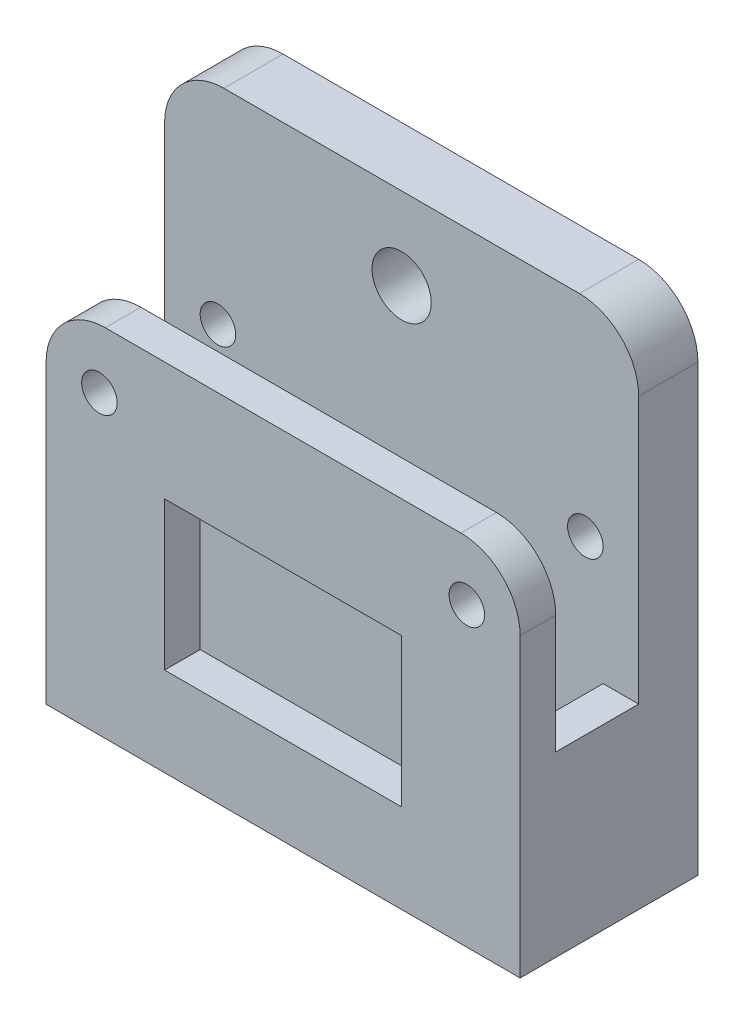
ISO-10303-21;
HEADER;
FILE_DESCRIPTION(('STEP AP214'),'2;1');
FILE_NAME('part.step','',(''),(''),'','','');
FILE_SCHEMA(('AUTOMOTIVE_DESIGN { 1 0 10303 214 1 1 1 1 }'));
ENDSEC;
DATA;
#1=APPLICATION_CONTEXT('core data for automotive mechanical design processes');
#2=APPLICATION_PROTOCOL_DEFINITION('international standard','automotive_design',2000,#1);
#3=PRODUCT_CONTEXT('',#1,'mechanical');
#4=PRODUCT('Part','Part','',(#3));
#5=PRODUCT_RELATED_PRODUCT_CATEGORY('part','',(#4));
#6=PRODUCT_DEFINITION_FORMATION('','',#4);
#7=PRODUCT_DEFINITION_CONTEXT('part definition',#1,'design');
#8=PRODUCT_DEFINITION('design','',#6,#7);
#9=PRODUCT_DEFINITION_SHAPE('','',#8);
#10=(LENGTH_UNIT() NAMED_UNIT(*) SI_UNIT(.MILLI.,.METRE.));
#11=(NAMED_UNIT(*) PLANE_ANGLE_UNIT() SI_UNIT($,.RADIAN.));
#12=(NAMED_UNIT(*) SI_UNIT($,.STERADIAN.) SOLID_ANGLE_UNIT());
#13=UNCERTAINTY_MEASURE_WITH_UNIT(LENGTH_MEASURE(1.E-05),#10,'distance_accuracy_value','');
#14=(GEOMETRIC_REPRESENTATION_CONTEXT(3) GLOBAL_UNCERTAINTY_ASSIGNED_CONTEXT((#13)) GLOBAL_UNIT_ASSIGNED_CONTEXT((#10,
#11,#12)) REPRESENTATION_CONTEXT('',''));
#15=CARTESIAN_POINT('',(0.,0.,0.));
#16=DIRECTION('',(0.,0.,1.));
#17=DIRECTION('',(1.,0.,0.));
#18=AXIS2_PLACEMENT_3D('',#15,#16,#17);
#19=CARTESIAN_POINT('',(380.458722726296,354.091279026258,15.));
#20=DIRECTION('',(1.,0.,0.));
#21=DIRECTION('',(0.,0.,-1.));
#22=AXIS2_PLACEMENT_3D('',#19,#20,#21);
#23=PLANE('',#22);
#24=DIRECTION('',(0.,-1.,0.));
#25=VECTOR('',#24,1.);
#26=CARTESIAN_POINT('',(380.458722726296,324.091279026258,5.));
#27=LINE('',#26,#25);
#28=CARTESIAN_POINT('',(380.458722726296,346.591279026258,5.));
#29=VERTEX_POINT('',#28);
#30=CARTESIAN_POINT('',(380.458722726296,324.091279026258,5.));
#31=VERTEX_POINT('',#30);
#32=EDGE_CURVE('E251',#29,#31,#27,.T.);
#33=ORIENTED_EDGE('',*,*,#32,.F.);
#34=DIRECTION('',(0.,0.,-1.));
#35=VECTOR('',#34,1.);
#36=CARTESIAN_POINT('',(380.458722726296,346.591279026258,15.));
#37=LINE('',#36,#35);
#38=CARTESIAN_POINT('',(380.458722726296,346.591279026258,0.));
#39=VERTEX_POINT('',#38);
#40=EDGE_CURVE('E362',#29,#39,#37,.T.);
#41=ORIENTED_EDGE('',*,*,#40,.T.);
#42=DIRECTION('',(0.,-1.,0.));
#43=VECTOR('',#42,1.);
#44=CARTESIAN_POINT('',(380.458722726296,354.091279026258,0.));
#45=LINE('',#44,#43);
#46=CARTESIAN_POINT('',(380.458722726296,309.076587086182,0.));
#47=VERTEX_POINT('',#46);
#48=EDGE_CURVE('E290',#39,#47,#45,.T.);
#49=ORIENTED_EDGE('',*,*,#48,.T.);
#50=DIRECTION('',(0.,0.,-1.));
#51=VECTOR('',#50,1.);
#52=CARTESIAN_POINT('',(380.458722726296,309.076587086182,50.));
#53=LINE('',#52,#51);
#54=CARTESIAN_POINT('',(380.458722726296,309.076587086182,15.));
#55=VERTEX_POINT('',#54);
#56=EDGE_CURVE('E230',#55,#47,#53,.T.);
#57=ORIENTED_EDGE('',*,*,#56,.F.);
#58=DIRECTION('',(0.,-1.,0.));
#59=VECTOR('',#58,1.);
#60=CARTESIAN_POINT('',(380.458722726296,354.091279026258,15.));
#61=LINE('',#60,#59);
#62=CARTESIAN_POINT('',(380.458722726296,334.091279026258,15.));
#63=VERTEX_POINT('',#62);
#64=EDGE_CURVE('E299',#63,#55,#61,.T.);
#65=ORIENTED_EDGE('',*,*,#64,.F.);
#66=DIRECTION('',(0.,0.,1.));
#67=VECTOR('',#66,1.);
#68=CARTESIAN_POINT('',(380.458722726296,334.091279026258,15.));
#69=LINE('',#68,#67);
#70=CARTESIAN_POINT('',(380.458722726296,334.091279026258,12.));
#71=VERTEX_POINT('',#70);
#72=EDGE_CURVE('E356',#63,#71,#69,.F.);
#73=ORIENTED_EDGE('',*,*,#72,.T.);
#74=DIRECTION('',(0.,1.,0.));
#75=VECTOR('',#74,1.);
#76=CARTESIAN_POINT('',(380.458722726296,324.091279026258,12.));
#77=LINE('',#76,#75);
#78=CARTESIAN_POINT('',(380.458722726296,324.091279026258,12.));
#79=VERTEX_POINT('',#78);
#80=EDGE_CURVE('E258',#79,#71,#77,.T.);
#81=ORIENTED_EDGE('',*,*,#80,.F.);
#82=DIRECTION('',(0.,0.,1.));
#83=VECTOR('',#82,1.);
#84=CARTESIAN_POINT('',(380.458722726296,324.091279026258,5.));
#85=LINE('',#84,#83);
#86=EDGE_CURVE('E254',#31,#79,#85,.T.);
#87=ORIENTED_EDGE('',*,*,#86,.F.);
#88=EDGE_LOOP('',(#33,#41,#49,#57,#65,#73,#81,#87));
#89=FACE_BOUND('',#88,.T.);
#90=ADVANCED_FACE('F39',(#89),#23,.F.);
#91=CARTESIAN_POINT('',(420.458722726296,354.091279026258,15.));
#92=DIRECTION('',(-1.,0.,0.));
#93=DIRECTION('',(0.,0.,1.));
#94=AXIS2_PLACEMENT_3D('',#91,#92,#93);
#95=PLANE('',#94);
#96=DIRECTION('',(0.,1.,0.));
#97=VECTOR('',#96,1.);
#98=CARTESIAN_POINT('',(420.458722726296,354.091279026258,0.));
#99=LINE('',#98,#97);
#100=CARTESIAN_POINT('',(420.458722726296,309.076587086182,0.));
#101=VERTEX_POINT('',#100);
#102=CARTESIAN_POINT('',(420.458722726296,346.591279026258,0.));
#103=VERTEX_POINT('',#102);
#104=EDGE_CURVE('E303',#101,#103,#99,.T.);
#105=ORIENTED_EDGE('',*,*,#104,.T.);
#106=DIRECTION('',(0.,0.,-1.));
#107=VECTOR('',#106,1.);
#108=CARTESIAN_POINT('',(420.458722726296,346.591279026258,15.));
#109=LINE('',#108,#107);
#110=CARTESIAN_POINT('',(420.458722726296,346.591279026258,5.));
#111=VERTEX_POINT('',#110);
#112=EDGE_CURVE('E389',#103,#111,#109,.F.);
#113=ORIENTED_EDGE('',*,*,#112,.T.);
#114=DIRECTION('',(0.,-1.,0.));
#115=VECTOR('',#114,1.);
#116=CARTESIAN_POINT('',(420.458722726296,354.091279026258,5.));
#117=LINE('',#116,#115);
#118=CARTESIAN_POINT('',(420.458722726296,324.091279026258,5.));
#119=VERTEX_POINT('',#118);
#120=EDGE_CURVE('E283',#111,#119,#117,.T.);
#121=ORIENTED_EDGE('',*,*,#120,.T.);
#122=DIRECTION('',(0.,0.,1.));
#123=VECTOR('',#122,1.);
#124=CARTESIAN_POINT('',(420.458722726296,324.091279026258,15.));
#125=LINE('',#124,#123);
#126=CARTESIAN_POINT('',(420.458722726296,324.091279026258,12.));
#127=VERTEX_POINT('',#126);
#128=EDGE_CURVE('E275',#119,#127,#125,.T.);
#129=ORIENTED_EDGE('',*,*,#128,.T.);
#130=DIRECTION('',(0.,1.,0.));
#131=VECTOR('',#130,1.);
#132=CARTESIAN_POINT('',(420.458722726296,354.091279026258,12.));
#133=LINE('',#132,#131);
#134=CARTESIAN_POINT('',(420.458722726296,334.091279026258,12.));
#135=VERTEX_POINT('',#134);
#136=EDGE_CURVE('E279',#127,#135,#133,.T.);
#137=ORIENTED_EDGE('',*,*,#136,.T.);
#138=DIRECTION('',(0.,0.,1.));
#139=VECTOR('',#138,1.);
#140=CARTESIAN_POINT('',(420.458722726296,334.091279026258,15.));
#141=LINE('',#140,#139);
#142=CARTESIAN_POINT('',(420.458722726296,334.091279026258,15.));
#143=VERTEX_POINT('',#142);
#144=EDGE_CURVE('E385',#135,#143,#141,.T.);
#145=ORIENTED_EDGE('',*,*,#144,.T.);
#146=DIRECTION('',(0.,1.,0.));
#147=VECTOR('',#146,1.);
#148=CARTESIAN_POINT('',(420.458722726296,354.091279026258,15.));
#149=LINE('',#148,#147);
#150=CARTESIAN_POINT('',(420.458722726296,309.076587086182,15.));
#151=VERTEX_POINT('',#150);
#152=EDGE_CURVE('E302',#151,#143,#149,.T.);
#153=ORIENTED_EDGE('',*,*,#152,.F.);
#154=DIRECTION('',(0.,0.,-1.));
#155=VECTOR('',#154,1.);
#156=CARTESIAN_POINT('',(420.458722726296,309.076587086182,50.));
#157=LINE('',#156,#155);
#158=EDGE_CURVE('E227',#151,#101,#157,.T.);
#159=ORIENTED_EDGE('',*,*,#158,.T.);
#160=EDGE_LOOP('',(#105,#113,#121,#129,#137,#145,#153,#159));
#161=FACE_BOUND('',#160,.T.);
#162=ADVANCED_FACE('F415',(#161),#95,.F.);
#163=CARTESIAN_POINT('',(0.,0.,15.));
#164=DIRECTION('',(0.,0.,1.));
#165=DIRECTION('',(1.,0.,0.));
#166=AXIS2_PLACEMENT_3D('',#163,#164,#165);
#167=PLANE('',#166);
#168=CARTESIAN_POINT('',(415.958722726296,334.091279026258,15.));
#169=DIRECTION('',(0.,0.,1.));
#170=DIRECTION('',(1.,0.,0.));
#171=AXIS2_PLACEMENT_3D('',#168,#169,#170);
#172=CIRCLE('',#171,1.50000000000002);
#173=CARTESIAN_POINT('',(417.458722726296,334.091279026258,15.));
#174=VERTEX_POINT('',#173);
#175=EDGE_CURVE('E706',#174,#174,#172,.T.);
#176=ORIENTED_EDGE('',*,*,#175,.F.);
#177=EDGE_LOOP('',(#176));
#178=FACE_BOUND('',#177,.T.);
#179=CARTESIAN_POINT('',(384.958722726296,334.091279026258,15.));
#180=DIRECTION('',(0.,0.,1.));
#181=DIRECTION('',(1.,0.,0.));
#182=AXIS2_PLACEMENT_3D('',#179,#180,#181);
#183=CIRCLE('',#182,1.50000000000002);
#184=CARTESIAN_POINT('',(386.458722726296,334.091279026258,15.));
#185=VERTEX_POINT('',#184);
#186=EDGE_CURVE('E744',#185,#185,#183,.T.);
#187=ORIENTED_EDGE('',*,*,#186,.F.);
#188=EDGE_LOOP('',(#187));
#189=FACE_BOUND('',#188,.T.);
#190=DIRECTION('',(0.,-1.,0.));
#191=VECTOR('',#190,1.);
#192=CARTESIAN_POINT('',(390.458722726296,316.576587086182,15.));
#193=LINE('',#192,#191);
#194=CARTESIAN_POINT('',(390.458722726296,329.091279026258,15.));
#195=VERTEX_POINT('',#194);
#196=CARTESIAN_POINT('',(390.458722726296,316.576587086182,15.));
#197=VERTEX_POINT('',#196);
#198=EDGE_CURVE('E200',#195,#197,#193,.T.);
#199=ORIENTED_EDGE('',*,*,#198,.F.);
#200=DIRECTION('',(-1.,0.,0.));
#201=VECTOR('',#200,1.);
#202=CARTESIAN_POINT('',(390.458722726296,329.091279026258,15.));
#203=LINE('',#202,#201);
#204=CARTESIAN_POINT('',(410.458722726296,329.091279026258,15.));
#205=VERTEX_POINT('',#204);
#206=EDGE_CURVE('E204',#205,#195,#203,.T.);
#207=ORIENTED_EDGE('',*,*,#206,.F.);
#208=DIRECTION('',(0.,1.,0.));
#209=VECTOR('',#208,1.);
#210=CARTESIAN_POINT('',(410.458722726296,316.576587086182,15.));
#211=LINE('',#210,#209);
#212=CARTESIAN_POINT('',(410.458722726296,316.576587086182,15.));
#213=VERTEX_POINT('',#212);
#214=EDGE_CURVE('E182',#213,#205,#211,.T.);
#215=ORIENTED_EDGE('',*,*,#214,.F.);
#216=DIRECTION('',(1.,0.,0.));
#217=VECTOR('',#216,1.);
#218=CARTESIAN_POINT('',(390.458722726296,316.576587086182,15.));
#219=LINE('',#218,#217);
#220=EDGE_CURVE('E194',#197,#213,#219,.T.);
#221=ORIENTED_EDGE('',*,*,#220,.F.);
#222=EDGE_LOOP('',(#199,#207,#215,#221));
#223=FACE_BOUND('',#222,.T.);
#224=ORIENTED_EDGE('',*,*,#152,.T.);
#225=CARTESIAN_POINT('',(415.458722726296,334.091279026258,15.));
#226=DIRECTION('',(0.,0.,1.));
#227=DIRECTION('',(1.,0.,0.));
#228=AXIS2_PLACEMENT_3D('',#225,#226,#227);
#229=CIRCLE('',#228,5.);
#230=CARTESIAN_POINT('',(415.458722726296,339.091279026258,15.));
#231=VERTEX_POINT('',#230);
#232=EDGE_CURVE('E62',#143,#231,#229,.T.);
#233=ORIENTED_EDGE('',*,*,#232,.T.);
#234=DIRECTION('',(1.,0.,0.));
#235=VECTOR('',#234,1.);
#236=CARTESIAN_POINT('',(380.458722726296,339.091279026258,15.));
#237=LINE('',#236,#235);
#238=CARTESIAN_POINT('',(385.458722726296,339.091279026258,15.));
#239=VERTEX_POINT('',#238);
#240=EDGE_CURVE('E214',#239,#231,#237,.T.);
#241=ORIENTED_EDGE('',*,*,#240,.F.);
#242=CARTESIAN_POINT('',(385.458722726296,334.091279026258,15.));
#243=DIRECTION('',(0.,0.,1.));
#244=DIRECTION('',(1.,0.,0.));
#245=AXIS2_PLACEMENT_3D('',#242,#243,#244);
#246=CIRCLE('',#245,5.);
#247=EDGE_CURVE('E353',#239,#63,#246,.T.);
#248=ORIENTED_EDGE('',*,*,#247,.T.);
#249=ORIENTED_EDGE('',*,*,#64,.T.);
#250=DIRECTION('',(-1.,0.,0.));
#251=VECTOR('',#250,1.);
#252=CARTESIAN_POINT('',(0.,309.076587086182,15.));
#253=LINE('',#252,#251);
#254=EDGE_CURVE('E247',#151,#55,#253,.T.);
#255=ORIENTED_EDGE('',*,*,#254,.F.);
#256=EDGE_LOOP('',(#224,#233,#241,#248,#249,#255));
#257=FACE_BOUND('',#256,.T.);
#258=ADVANCED_FACE('F202',(#178,#189,#223,#257),#167,.T.);
#259=CARTESIAN_POINT('',(0.,0.,0.));
#260=DIRECTION('',(0.,0.,1.));
#261=DIRECTION('',(1.,0.,0.));
#262=AXIS2_PLACEMENT_3D('',#259,#260,#261);
#263=PLANE('',#262);
#264=CARTESIAN_POINT('',(415.958722726296,334.091279026258,0.));
#265=DIRECTION('',(0.,0.,1.));
#266=DIRECTION('',(1.,0.,0.));
#267=AXIS2_PLACEMENT_3D('',#264,#265,#266);
#268=CIRCLE('',#267,1.50000000000002);
#269=CARTESIAN_POINT('',(417.458722726296,334.091279026258,0.));
#270=VERTEX_POINT('',#269);
#271=EDGE_CURVE('E344',#270,#270,#268,.T.);
#272=ORIENTED_EDGE('',*,*,#271,.T.);
#273=EDGE_LOOP('',(#272));
#274=FACE_BOUND('',#273,.T.);
#275=CARTESIAN_POINT('',(384.958722726296,334.091279026258,0.));
#276=DIRECTION('',(0.,0.,1.));
#277=DIRECTION('',(1.,0.,0.));
#278=AXIS2_PLACEMENT_3D('',#275,#276,#277);
#279=CIRCLE('',#278,1.50000000000002);
#280=CARTESIAN_POINT('',(386.458722726296,334.091279026258,0.));
#281=VERTEX_POINT('',#280);
#282=EDGE_CURVE('E748',#281,#281,#279,.T.);
#283=ORIENTED_EDGE('',*,*,#282,.T.);
#284=EDGE_LOOP('',(#283));
#285=FACE_BOUND('',#284,.T.);
#286=CARTESIAN_POINT('',(400.458722726296,344.660615352602,0.));
#287=DIRECTION('',(0.,0.,1.));
#288=DIRECTION('',(1.,0.,0.));
#289=AXIS2_PLACEMENT_3D('',#286,#287,#288);
#290=CIRCLE('',#289,2.50000000000002);
#291=CARTESIAN_POINT('',(402.958722726296,344.660615352602,0.));
#292=VERTEX_POINT('',#291);
#293=EDGE_CURVE('E719',#292,#292,#290,.T.);
#294=ORIENTED_EDGE('',*,*,#293,.T.);
#295=EDGE_LOOP('',(#294));
#296=FACE_BOUND('',#295,.T.);
#297=CARTESIAN_POINT('',(400.458722726296,322.932953384925,0.));
#298=DIRECTION('',(0.,0.,1.));
#299=DIRECTION('',(1.,0.,0.));
#300=AXIS2_PLACEMENT_3D('',#297,#298,#299);
#301=CIRCLE('',#300,2.50000000000002);
#302=CARTESIAN_POINT('',(402.958722726296,322.932953384925,0.));
#303=VERTEX_POINT('',#302);
#304=EDGE_CURVE('E714',#303,#303,#301,.T.);
#305=ORIENTED_EDGE('',*,*,#304,.T.);
#306=EDGE_LOOP('',(#305));
#307=FACE_BOUND('',#306,.T.);
#308=ORIENTED_EDGE('',*,*,#48,.F.);
#309=CARTESIAN_POINT('',(385.458722726296,346.591279026258,0.));
#310=DIRECTION('',(0.,0.,1.));
#311=DIRECTION('',(1.,0.,0.));
#312=AXIS2_PLACEMENT_3D('',#309,#310,#311);
#313=CIRCLE('',#312,5.);
#314=CARTESIAN_POINT('',(385.458722726296,351.591279026258,0.));
#315=VERTEX_POINT('',#314);
#316=EDGE_CURVE('E369',#39,#315,#313,.F.);
#317=ORIENTED_EDGE('',*,*,#316,.T.);
#318=DIRECTION('',(-1.,0.,0.));
#319=VECTOR('',#318,1.);
#320=CARTESIAN_POINT('',(380.458722726296,351.591279026258,0.));
#321=LINE('',#320,#319);
#322=CARTESIAN_POINT('',(415.458722726296,351.591279026258,0.));
#323=VERTEX_POINT('',#322);
#324=EDGE_CURVE('E222',#323,#315,#321,.T.);
#325=ORIENTED_EDGE('',*,*,#324,.F.);
#326=CARTESIAN_POINT('',(415.458722726296,346.591279026258,0.));
#327=DIRECTION('',(0.,0.,1.));
#328=DIRECTION('',(1.,0.,0.));
#329=AXIS2_PLACEMENT_3D('',#326,#327,#328);
#330=CIRCLE('',#329,5.);
#331=EDGE_CURVE('E366',#323,#103,#330,.F.);
#332=ORIENTED_EDGE('',*,*,#331,.T.);
#333=ORIENTED_EDGE('',*,*,#104,.F.);
#334=DIRECTION('',(1.,0.,0.));
#335=VECTOR('',#334,1.);
#336=CARTESIAN_POINT('',(420.458722726296,309.076587086182,0.));
#337=LINE('',#336,#335);
#338=EDGE_CURVE('E221',#47,#101,#337,.T.);
#339=ORIENTED_EDGE('',*,*,#338,.F.);
#340=EDGE_LOOP('',(#308,#317,#325,#332,#333,#339));
#341=FACE_BOUND('',#340,.T.);
#342=ADVANCED_FACE('F430',(#274,#285,#296,#307,#341),#263,.F.);
#343=CARTESIAN_POINT('',(383.458722726296,304.091279026258,12.));
#344=DIRECTION('',(0.,0.,1.));
#345=DIRECTION('',(1.,0.,0.));
#346=AXIS2_PLACEMENT_3D('',#343,#344,#345);
#347=PLANE('',#346);
#348=CARTESIAN_POINT('',(415.958722726296,334.091279026258,12.));
#349=DIRECTION('',(0.,0.,1.));
#350=DIRECTION('',(1.,0.,0.));
#351=AXIS2_PLACEMENT_3D('',#348,#349,#350);
#352=CIRCLE('',#351,1.50000000000002);
#353=CARTESIAN_POINT('',(417.458722726296,334.091279026258,12.));
#354=VERTEX_POINT('',#353);
#355=EDGE_CURVE('E349',#354,#354,#352,.T.);
#356=ORIENTED_EDGE('',*,*,#355,.T.);
#357=EDGE_LOOP('',(#356));
#358=FACE_BOUND('',#357,.T.);
#359=CARTESIAN_POINT('',(384.958722726296,334.091279026258,12.));
#360=DIRECTION('',(0.,0.,1.));
#361=DIRECTION('',(1.,0.,0.));
#362=AXIS2_PLACEMENT_3D('',#359,#360,#361);
#363=CIRCLE('',#362,1.50000000000002);
#364=CARTESIAN_POINT('',(386.458722726296,334.091279026258,12.));
#365=VERTEX_POINT('',#364);
#366=EDGE_CURVE('E343',#365,#365,#363,.T.);
#367=ORIENTED_EDGE('',*,*,#366,.T.);
#368=EDGE_LOOP('',(#367));
#369=FACE_BOUND('',#368,.T.);
#370=DIRECTION('',(-1.,0.,0.));
#371=VECTOR('',#370,1.);
#372=CARTESIAN_POINT('',(383.458722726296,329.091279026258,12.));
#373=LINE('',#372,#371);
#374=CARTESIAN_POINT('',(410.458722726296,329.091279026258,12.));
#375=VERTEX_POINT('',#374);
#376=CARTESIAN_POINT('',(390.458722726296,329.091279026258,12.));
#377=VERTEX_POINT('',#376);
#378=EDGE_CURVE('E330',#375,#377,#373,.T.);
#379=ORIENTED_EDGE('',*,*,#378,.T.);
#380=DIRECTION('',(0.,-1.,0.));
#381=VECTOR('',#380,1.);
#382=CARTESIAN_POINT('',(390.458722726296,304.091279026258,12.));
#383=LINE('',#382,#381);
#384=CARTESIAN_POINT('',(390.458722726296,316.576587086182,12.));
#385=VERTEX_POINT('',#384);
#386=EDGE_CURVE('E334',#377,#385,#383,.T.);
#387=ORIENTED_EDGE('',*,*,#386,.T.);
#388=DIRECTION('',(1.,0.,0.));
#389=VECTOR('',#388,1.);
#390=CARTESIAN_POINT('',(383.458722726296,316.576587086182,12.));
#391=LINE('',#390,#389);
#392=CARTESIAN_POINT('',(410.458722726296,316.576587086182,12.));
#393=VERTEX_POINT('',#392);
#394=EDGE_CURVE('E325',#385,#393,#391,.T.);
#395=ORIENTED_EDGE('',*,*,#394,.T.);
#396=DIRECTION('',(0.,1.,0.));
#397=VECTOR('',#396,1.);
#398=CARTESIAN_POINT('',(410.458722726296,304.091279026258,12.));
#399=LINE('',#398,#397);
#400=EDGE_CURVE('E185',#393,#375,#399,.T.);
#401=ORIENTED_EDGE('',*,*,#400,.T.);
#402=EDGE_LOOP('',(#379,#387,#395,#401));
#403=FACE_BOUND('',#402,.T.);
#404=DIRECTION('',(1.,0.,0.));
#405=VECTOR('',#404,1.);
#406=CARTESIAN_POINT('',(383.458722726296,339.091279026258,12.));
#407=LINE('',#406,#405);
#408=CARTESIAN_POINT('',(385.458722726296,339.091279026258,12.));
#409=VERTEX_POINT('',#408);
#410=CARTESIAN_POINT('',(415.458722726296,339.091279026258,12.));
#411=VERTEX_POINT('',#410);
#412=EDGE_CURVE('E322',#409,#411,#407,.T.);
#413=ORIENTED_EDGE('',*,*,#412,.T.);
#414=CARTESIAN_POINT('',(415.458722726296,334.091279026258,12.));
#415=DIRECTION('',(0.,0.,1.));
#416=DIRECTION('',(1.,0.,0.));
#417=AXIS2_PLACEMENT_3D('',#414,#415,#416);
#418=CIRCLE('',#417,5.);
#419=EDGE_CURVE('E11',#411,#135,#418,.F.);
#420=ORIENTED_EDGE('',*,*,#419,.T.);
#421=ORIENTED_EDGE('',*,*,#136,.F.);
#422=DIRECTION('',(-1.,0.,0.));
#423=VECTOR('',#422,1.);
#424=CARTESIAN_POINT('',(430.458722726296,324.091279026258,12.));
#425=LINE('',#424,#423);
#426=CARTESIAN_POINT('',(417.458722726296,324.091279026258,12.));
#427=VERTEX_POINT('',#426);
#428=EDGE_CURVE('E266',#127,#427,#425,.T.);
#429=ORIENTED_EDGE('',*,*,#428,.T.);
#430=DIRECTION('',(0.,1.,0.));
#431=VECTOR('',#430,1.);
#432=CARTESIAN_POINT('',(417.458722726296,304.091279026258,12.));
#433=LINE('',#432,#431);
#434=CARTESIAN_POINT('',(417.458722726296,309.076587086182,12.));
#435=VERTEX_POINT('',#434);
#436=EDGE_CURVE('E286',#435,#427,#433,.T.);
#437=ORIENTED_EDGE('',*,*,#436,.F.);
#438=DIRECTION('',(-1.,0.,0.));
#439=VECTOR('',#438,1.);
#440=CARTESIAN_POINT('',(383.458722726296,309.076587086182,12.));
#441=LINE('',#440,#439);
#442=CARTESIAN_POINT('',(383.458722726296,309.076587086182,12.));
#443=VERTEX_POINT('',#442);
#444=EDGE_CURVE('E243',#435,#443,#441,.T.);
#445=ORIENTED_EDGE('',*,*,#444,.T.);
#446=DIRECTION('',(0.,1.,0.));
#447=VECTOR('',#446,1.);
#448=CARTESIAN_POINT('',(383.458722726296,304.091279026258,12.));
#449=LINE('',#448,#447);
#450=CARTESIAN_POINT('',(383.458722726296,324.091279026258,12.));
#451=VERTEX_POINT('',#450);
#452=EDGE_CURVE('E287',#443,#451,#449,.T.);
#453=ORIENTED_EDGE('',*,*,#452,.T.);
#454=EDGE_CURVE('E263',#451,#79,#425,.T.);
#455=ORIENTED_EDGE('',*,*,#454,.T.);
#456=ORIENTED_EDGE('',*,*,#80,.T.);
#457=CARTESIAN_POINT('',(385.458722726296,334.091279026258,12.));
#458=DIRECTION('',(0.,0.,1.));
#459=DIRECTION('',(1.,0.,0.));
#460=AXIS2_PLACEMENT_3D('',#457,#458,#459);
#461=CIRCLE('',#460,5.);
#462=EDGE_CURVE('E359',#71,#409,#461,.F.);
#463=ORIENTED_EDGE('',*,*,#462,.T.);
#464=EDGE_LOOP('',(#413,#420,#421,#429,#437,#445,#453,#455,#456,#463));
#465=FACE_BOUND('',#464,.T.);
#466=ADVANCED_FACE('F412',(#358,#369,#403,#465),#347,.F.);
#467=CARTESIAN_POINT('',(383.458722726296,304.091279026258,5.));
#468=DIRECTION('',(-1.,0.,0.));
#469=DIRECTION('',(0.,0.,1.));
#470=AXIS2_PLACEMENT_3D('',#467,#468,#469);
#471=PLANE('',#470);
#472=ORIENTED_EDGE('',*,*,#452,.F.);
#473=DIRECTION('',(0.,0.,-1.));
#474=VECTOR('',#473,1.);
#475=CARTESIAN_POINT('',(383.458722726296,309.076587086182,5.));
#476=LINE('',#475,#474);
#477=CARTESIAN_POINT('',(383.458722726296,309.076587086182,5.));
#478=VERTEX_POINT('',#477);
#479=EDGE_CURVE('E239',#443,#478,#476,.T.);
#480=ORIENTED_EDGE('',*,*,#479,.T.);
#481=DIRECTION('',(0.,1.,0.));
#482=VECTOR('',#481,1.);
#483=CARTESIAN_POINT('',(383.458722726296,304.091279026258,5.));
#484=LINE('',#483,#482);
#485=CARTESIAN_POINT('',(383.458722726296,324.091279026258,5.));
#486=VERTEX_POINT('',#485);
#487=EDGE_CURVE('E291',#478,#486,#484,.T.);
#488=ORIENTED_EDGE('',*,*,#487,.T.);
#489=DIRECTION('',(0.,0.,1.));
#490=VECTOR('',#489,1.);
#491=CARTESIAN_POINT('',(383.458722726296,324.091279026258,5.));
#492=LINE('',#491,#490);
#493=EDGE_CURVE('E271',#486,#451,#492,.T.);
#494=ORIENTED_EDGE('',*,*,#493,.T.);
#495=EDGE_LOOP('',(#472,#480,#488,#494));
#496=FACE_BOUND('',#495,.T.);
#497=ADVANCED_FACE('F449',(#496),#471,.F.);
#498=CARTESIAN_POINT('',(383.458722726296,304.091279026258,5.));
#499=DIRECTION('',(0.,0.,1.));
#500=DIRECTION('',(1.,0.,0.));
#501=AXIS2_PLACEMENT_3D('',#498,#499,#500);
#502=PLANE('',#501);
#503=CARTESIAN_POINT('',(415.958722726296,334.091279026258,5.));
#504=DIRECTION('',(0.,0.,1.));
#505=DIRECTION('',(1.,0.,0.));
#506=AXIS2_PLACEMENT_3D('',#503,#504,#505);
#507=CIRCLE('',#506,1.50000000000002);
#508=CARTESIAN_POINT('',(417.458722726296,334.091279026258,5.));
#509=VERTEX_POINT('',#508);
#510=EDGE_CURVE('E345',#509,#509,#507,.T.);
#511=ORIENTED_EDGE('',*,*,#510,.F.);
#512=EDGE_LOOP('',(#511));
#513=FACE_BOUND('',#512,.T.);
#514=CARTESIAN_POINT('',(384.958722726296,334.091279026258,5.));
#515=DIRECTION('',(0.,0.,1.));
#516=DIRECTION('',(1.,0.,0.));
#517=AXIS2_PLACEMENT_3D('',#514,#515,#516);
#518=CIRCLE('',#517,1.50000000000002);
#519=CARTESIAN_POINT('',(386.458722726296,334.091279026258,5.));
#520=VERTEX_POINT('',#519);
#521=EDGE_CURVE('E339',#520,#520,#518,.T.);
#522=ORIENTED_EDGE('',*,*,#521,.F.);
#523=EDGE_LOOP('',(#522));
#524=FACE_BOUND('',#523,.T.);
#525=CARTESIAN_POINT('',(400.458722726296,344.660615352602,5.));
#526=DIRECTION('',(0.,0.,1.));
#527=DIRECTION('',(1.,0.,0.));
#528=AXIS2_PLACEMENT_3D('',#525,#526,#527);
#529=CIRCLE('',#528,2.50000000000002);
#530=CARTESIAN_POINT('',(402.958722726296,344.660615352602,5.));
#531=VERTEX_POINT('',#530);
#532=EDGE_CURVE('E723',#531,#531,#529,.T.);
#533=ORIENTED_EDGE('',*,*,#532,.F.);
#534=EDGE_LOOP('',(#533));
#535=FACE_BOUND('',#534,.T.);
#536=CARTESIAN_POINT('',(400.458722726296,322.932953384925,5.));
#537=DIRECTION('',(0.,0.,1.));
#538=DIRECTION('',(1.,0.,0.));
#539=AXIS2_PLACEMENT_3D('',#536,#537,#538);
#540=CIRCLE('',#539,2.50000000000002);
#541=CARTESIAN_POINT('',(402.958722726296,322.932953384925,5.));
#542=VERTEX_POINT('',#541);
#543=EDGE_CURVE('E710',#542,#542,#540,.T.);
#544=ORIENTED_EDGE('',*,*,#543,.F.);
#545=EDGE_LOOP('',(#544));
#546=FACE_BOUND('',#545,.T.);
#547=DIRECTION('',(1.,0.,0.));
#548=VECTOR('',#547,1.);
#549=CARTESIAN_POINT('',(383.458722726296,351.591279026258,5.));
#550=LINE('',#549,#548);
#551=CARTESIAN_POINT('',(385.458722726296,351.591279026258,5.));
#552=VERTEX_POINT('',#551);
#553=CARTESIAN_POINT('',(415.458722726296,351.591279026258,5.));
#554=VERTEX_POINT('',#553);
#555=EDGE_CURVE('E318',#552,#554,#550,.T.);
#556=ORIENTED_EDGE('',*,*,#555,.F.);
#557=CARTESIAN_POINT('',(385.458722726296,346.591279026258,5.));
#558=DIRECTION('',(0.,0.,1.));
#559=DIRECTION('',(1.,0.,0.));
#560=AXIS2_PLACEMENT_3D('',#557,#558,#559);
#561=CIRCLE('',#560,5.);
#562=EDGE_CURVE('E382',#552,#29,#561,.T.);
#563=ORIENTED_EDGE('',*,*,#562,.T.);
#564=ORIENTED_EDGE('',*,*,#32,.T.);
#565=DIRECTION('',(-1.,0.,0.));
#566=VECTOR('',#565,1.);
#567=CARTESIAN_POINT('',(430.458722726296,324.091279026258,5.));
#568=LINE('',#567,#566);
#569=EDGE_CURVE('E262',#486,#31,#568,.T.);
#570=ORIENTED_EDGE('',*,*,#569,.F.);
#571=ORIENTED_EDGE('',*,*,#487,.F.);
#572=DIRECTION('',(-1.,0.,0.));
#573=VECTOR('',#572,1.);
#574=CARTESIAN_POINT('',(383.458722726296,309.076587086182,5.));
#575=LINE('',#574,#573);
#576=CARTESIAN_POINT('',(417.458722726296,309.076587086182,5.));
#577=VERTEX_POINT('',#576);
#578=EDGE_CURVE('E226',#577,#478,#575,.T.);
#579=ORIENTED_EDGE('',*,*,#578,.F.);
#580=DIRECTION('',(0.,1.,0.));
#581=VECTOR('',#580,1.);
#582=CARTESIAN_POINT('',(417.458722726296,304.091279026258,5.));
#583=LINE('',#582,#581);
#584=CARTESIAN_POINT('',(417.458722726296,324.091279026258,5.));
#585=VERTEX_POINT('',#584);
#586=EDGE_CURVE('E294',#577,#585,#583,.T.);
#587=ORIENTED_EDGE('',*,*,#586,.T.);
#588=EDGE_CURVE('E267',#119,#585,#568,.T.);
#589=ORIENTED_EDGE('',*,*,#588,.F.);
#590=ORIENTED_EDGE('',*,*,#120,.F.);
#591=CARTESIAN_POINT('',(415.458722726296,346.591279026258,5.));
#592=DIRECTION('',(0.,0.,1.));
#593=DIRECTION('',(1.,0.,0.));
#594=AXIS2_PLACEMENT_3D('',#591,#592,#593);
#595=CIRCLE('',#594,5.);
#596=EDGE_CURVE('E379',#111,#554,#595,.T.);
#597=ORIENTED_EDGE('',*,*,#596,.T.);
#598=EDGE_LOOP('',(#556,#563,#564,#570,#571,#579,#587,#589,#590,#597));
#599=FACE_BOUND('',#598,.T.);
#600=ADVANCED_FACE('F420',(#513,#524,#535,#546,#599),#502,.T.);
#601=CARTESIAN_POINT('',(417.458722726296,304.091279026258,5.));
#602=DIRECTION('',(-1.,0.,0.));
#603=DIRECTION('',(0.,0.,1.));
#604=AXIS2_PLACEMENT_3D('',#601,#602,#603);
#605=PLANE('',#604);
#606=DIRECTION('',(0.,0.,-1.));
#607=VECTOR('',#606,1.);
#608=CARTESIAN_POINT('',(417.458722726296,309.076587086182,5.));
#609=LINE('',#608,#607);
#610=EDGE_CURVE('E315',#435,#577,#609,.T.);
#611=ORIENTED_EDGE('',*,*,#610,.F.);
#612=ORIENTED_EDGE('',*,*,#436,.T.);
#613=DIRECTION('',(0.,0.,1.));
#614=VECTOR('',#613,1.);
#615=CARTESIAN_POINT('',(417.458722726296,324.091279026258,5.));
#616=LINE('',#615,#614);
#617=EDGE_CURVE('E306',#585,#427,#616,.T.);
#618=ORIENTED_EDGE('',*,*,#617,.F.);
#619=ORIENTED_EDGE('',*,*,#586,.F.);
#620=EDGE_LOOP('',(#611,#612,#618,#619));
#621=FACE_BOUND('',#620,.T.);
#622=ADVANCED_FACE('F409',(#621),#605,.T.);
#623=CARTESIAN_POINT('',(430.458722726296,324.091279026258,5.));
#624=DIRECTION('',(0.,-1.,0.));
#625=DIRECTION('',(0.,0.,-1.));
#626=AXIS2_PLACEMENT_3D('',#623,#624,#625);
#627=PLANE('',#626);
#628=ORIENTED_EDGE('',*,*,#588,.T.);
#629=ORIENTED_EDGE('',*,*,#617,.T.);
#630=ORIENTED_EDGE('',*,*,#428,.F.);
#631=ORIENTED_EDGE('',*,*,#128,.F.);
#632=EDGE_LOOP('',(#628,#629,#630,#631));
#633=FACE_BOUND('',#632,.T.);
#634=ADVANCED_FACE('F402',(#633),#627,.F.);
#635=ORIENTED_EDGE('',*,*,#569,.T.);
#636=ORIENTED_EDGE('',*,*,#86,.T.);
#637=ORIENTED_EDGE('',*,*,#454,.F.);
#638=ORIENTED_EDGE('',*,*,#493,.F.);
#639=EDGE_LOOP('',(#635,#636,#637,#638));
#640=FACE_BOUND('',#639,.T.);
#641=ADVANCED_FACE('F446',(#640),#627,.F.);
#642=CARTESIAN_POINT('',(420.458722726296,309.076587086182,50.));
#643=DIRECTION('',(0.,1.,0.));
#644=DIRECTION('',(0.,0.,1.));
#645=AXIS2_PLACEMENT_3D('',#642,#643,#644);
#646=PLANE('',#645);
#647=ORIENTED_EDGE('',*,*,#254,.T.);
#648=ORIENTED_EDGE('',*,*,#56,.T.);
#649=ORIENTED_EDGE('',*,*,#338,.T.);
#650=ORIENTED_EDGE('',*,*,#158,.F.);
#651=EDGE_LOOP('',(#647,#648,#649,#650));
#652=FACE_BOUND('',#651,.T.);
#653=ORIENTED_EDGE('',*,*,#610,.T.);
#654=ORIENTED_EDGE('',*,*,#578,.T.);
#655=ORIENTED_EDGE('',*,*,#479,.F.);
#656=ORIENTED_EDGE('',*,*,#444,.F.);
#657=EDGE_LOOP('',(#653,#654,#655,#656));
#658=FACE_BOUND('',#657,.T.);
#659=ADVANCED_FACE('F452',(#652,#658),#646,.F.);
#660=CARTESIAN_POINT('',(380.458722726296,351.591279026258,50.));
#661=DIRECTION('',(0.,-1.,0.));
#662=DIRECTION('',(0.,0.,-1.));
#663=AXIS2_PLACEMENT_3D('',#660,#661,#662);
#664=PLANE('',#663);
#665=ORIENTED_EDGE('',*,*,#324,.T.);
#666=DIRECTION('',(0.,0.,-1.));
#667=VECTOR('',#666,1.);
#668=CARTESIAN_POINT('',(385.458722726296,351.591279026258,50.));
#669=LINE('',#668,#667);
#670=EDGE_CURVE('E376',#315,#552,#669,.F.);
#671=ORIENTED_EDGE('',*,*,#670,.T.);
#672=ORIENTED_EDGE('',*,*,#555,.T.);
#673=DIRECTION('',(0.,0.,-1.));
#674=VECTOR('',#673,1.);
#675=CARTESIAN_POINT('',(415.458722726296,351.591279026258,50.));
#676=LINE('',#675,#674);
#677=EDGE_CURVE('E372',#554,#323,#676,.T.);
#678=ORIENTED_EDGE('',*,*,#677,.T.);
#679=EDGE_LOOP('',(#665,#671,#672,#678));
#680=FACE_BOUND('',#679,.T.);
#681=ADVANCED_FACE('F426',(#680),#664,.F.);
#682=CARTESIAN_POINT('',(380.458722726296,339.091279026258,10.));
#683=DIRECTION('',(0.,-1.,0.));
#684=DIRECTION('',(0.,0.,-1.));
#685=AXIS2_PLACEMENT_3D('',#682,#683,#684);
#686=PLANE('',#685);
#687=ORIENTED_EDGE('',*,*,#240,.T.);
#688=DIRECTION('',(0.,0.,1.));
#689=VECTOR('',#688,1.);
#690=CARTESIAN_POINT('',(415.458722726296,339.091279026258,10.));
#691=LINE('',#690,#689);
#692=EDGE_CURVE('E48',#231,#411,#691,.F.);
#693=ORIENTED_EDGE('',*,*,#692,.T.);
#694=ORIENTED_EDGE('',*,*,#412,.F.);
#695=DIRECTION('',(0.,0.,1.));
#696=VECTOR('',#695,1.);
#697=CARTESIAN_POINT('',(385.458722726296,339.091279026258,10.));
#698=LINE('',#697,#696);
#699=EDGE_CURVE('E338',#409,#239,#698,.T.);
#700=ORIENTED_EDGE('',*,*,#699,.T.);
#701=EDGE_LOOP('',(#687,#693,#694,#700));
#702=FACE_BOUND('',#701,.T.);
#703=ADVANCED_FACE('F460',(#702),#686,.F.);
#704=CARTESIAN_POINT('',(390.458722726296,316.576587086182,10.));
#705=DIRECTION('',(-1.,0.,0.));
#706=DIRECTION('',(0.,0.,1.));
#707=AXIS2_PLACEMENT_3D('',#704,#705,#706);
#708=PLANE('',#707);
#709=DIRECTION('',(0.,0.,1.));
#710=VECTOR('',#709,1.);
#711=CARTESIAN_POINT('',(390.458722726296,329.091279026258,10.));
#712=LINE('',#711,#710);
#713=EDGE_CURVE('E211',#377,#195,#712,.T.);
#714=ORIENTED_EDGE('',*,*,#713,.T.);
#715=ORIENTED_EDGE('',*,*,#198,.T.);
#716=DIRECTION('',(0.,0.,1.));
#717=VECTOR('',#716,1.);
#718=CARTESIAN_POINT('',(390.458722726296,316.576587086182,10.));
#719=LINE('',#718,#717);
#720=EDGE_CURVE('E190',#385,#197,#719,.T.);
#721=ORIENTED_EDGE('',*,*,#720,.F.);
#722=ORIENTED_EDGE('',*,*,#386,.F.);
#723=EDGE_LOOP('',(#714,#715,#721,#722));
#724=FACE_BOUND('',#723,.T.);
#725=ADVANCED_FACE('F542',(#724),#708,.F.);
#726=CARTESIAN_POINT('',(390.458722726296,329.091279026258,10.));
#727=DIRECTION('',(0.,1.,0.));
#728=DIRECTION('',(0.,0.,1.));
#729=AXIS2_PLACEMENT_3D('',#726,#727,#728);
#730=PLANE('',#729);
#731=DIRECTION('',(0.,0.,1.));
#732=VECTOR('',#731,1.);
#733=CARTESIAN_POINT('',(410.458722726296,329.091279026258,10.));
#734=LINE('',#733,#732);
#735=EDGE_CURVE('E189',#375,#205,#734,.T.);
#736=ORIENTED_EDGE('',*,*,#735,.T.);
#737=ORIENTED_EDGE('',*,*,#206,.T.);
#738=ORIENTED_EDGE('',*,*,#713,.F.);
#739=ORIENTED_EDGE('',*,*,#378,.F.);
#740=EDGE_LOOP('',(#736,#737,#738,#739));
#741=FACE_BOUND('',#740,.T.);
#742=ADVANCED_FACE('F547',(#741),#730,.F.);
#743=CARTESIAN_POINT('',(410.458722726296,316.576587086182,10.));
#744=DIRECTION('',(1.,0.,0.));
#745=DIRECTION('',(0.,0.,-1.));
#746=AXIS2_PLACEMENT_3D('',#743,#744,#745);
#747=PLANE('',#746);
#748=DIRECTION('',(0.,0.,1.));
#749=VECTOR('',#748,1.);
#750=CARTESIAN_POINT('',(410.458722726296,316.576587086182,10.));
#751=LINE('',#750,#749);
#752=EDGE_CURVE('E177',#393,#213,#751,.T.);
#753=ORIENTED_EDGE('',*,*,#752,.T.);
#754=ORIENTED_EDGE('',*,*,#214,.T.);
#755=ORIENTED_EDGE('',*,*,#735,.F.);
#756=ORIENTED_EDGE('',*,*,#400,.F.);
#757=EDGE_LOOP('',(#753,#754,#755,#756));
#758=FACE_BOUND('',#757,.T.);
#759=ADVANCED_FACE('F179',(#758),#747,.F.);
#760=CARTESIAN_POINT('',(390.458722726296,316.576587086182,10.));
#761=DIRECTION('',(0.,-1.,0.));
#762=DIRECTION('',(0.,0.,-1.));
#763=AXIS2_PLACEMENT_3D('',#760,#761,#762);
#764=PLANE('',#763);
#765=ORIENTED_EDGE('',*,*,#720,.T.);
#766=ORIENTED_EDGE('',*,*,#220,.T.);
#767=ORIENTED_EDGE('',*,*,#752,.F.);
#768=ORIENTED_EDGE('',*,*,#394,.F.);
#769=EDGE_LOOP('',(#765,#766,#767,#768));
#770=FACE_BOUND('',#769,.T.);
#771=ADVANCED_FACE('F195',(#770),#764,.F.);
#772=CARTESIAN_POINT('',(400.458722726296,322.932953384925,0.));
#773=DIRECTION('',(0.,0.,1.));
#774=DIRECTION('',(1.,0.,0.));
#775=AXIS2_PLACEMENT_3D('',#772,#773,#774);
#776=CYLINDRICAL_SURFACE('',#775,2.50000000000002);
#777=ORIENTED_EDGE('',*,*,#304,.F.);
#778=EDGE_LOOP('',(#777));
#779=FACE_BOUND('',#778,.T.);
#780=ORIENTED_EDGE('',*,*,#543,.T.);
#781=EDGE_LOOP('',(#780));
#782=FACE_BOUND('',#781,.T.);
#783=ADVANCED_FACE('F576',(#779,#782),#776,.F.);
#784=CARTESIAN_POINT('',(400.458722726296,344.660615352602,0.));
#785=DIRECTION('',(0.,0.,1.));
#786=DIRECTION('',(1.,0.,0.));
#787=AXIS2_PLACEMENT_3D('',#784,#785,#786);
#788=CYLINDRICAL_SURFACE('',#787,2.50000000000002);
#789=ORIENTED_EDGE('',*,*,#293,.F.);
#790=EDGE_LOOP('',(#789));
#791=FACE_BOUND('',#790,.T.);
#792=ORIENTED_EDGE('',*,*,#532,.T.);
#793=EDGE_LOOP('',(#792));
#794=FACE_BOUND('',#793,.T.);
#795=ADVANCED_FACE('F585',(#791,#794),#788,.F.);
#796=CARTESIAN_POINT('',(384.958722726296,334.091279026258,0.));
#797=DIRECTION('',(0.,0.,1.));
#798=DIRECTION('',(1.,0.,0.));
#799=AXIS2_PLACEMENT_3D('',#796,#797,#798);
#800=CYLINDRICAL_SURFACE('',#799,1.50000000000002);
#801=ORIENTED_EDGE('',*,*,#521,.T.);
#802=EDGE_LOOP('',(#801));
#803=FACE_BOUND('',#802,.T.);
#804=ORIENTED_EDGE('',*,*,#282,.F.);
#805=EDGE_LOOP('',(#804));
#806=FACE_BOUND('',#805,.T.);
#807=ADVANCED_FACE('F595',(#803,#806),#800,.F.);
#808=CARTESIAN_POINT('',(415.958722726296,334.091279026258,0.));
#809=DIRECTION('',(0.,0.,1.));
#810=DIRECTION('',(1.,0.,0.));
#811=AXIS2_PLACEMENT_3D('',#808,#809,#810);
#812=CYLINDRICAL_SURFACE('',#811,1.50000000000002);
#813=ORIENTED_EDGE('',*,*,#510,.T.);
#814=EDGE_LOOP('',(#813));
#815=FACE_BOUND('',#814,.T.);
#816=ORIENTED_EDGE('',*,*,#271,.F.);
#817=EDGE_LOOP('',(#816));
#818=FACE_BOUND('',#817,.T.);
#819=ADVANCED_FACE('F605',(#815,#818),#812,.F.);
#820=ORIENTED_EDGE('',*,*,#186,.T.);
#821=EDGE_LOOP('',(#820));
#822=FACE_BOUND('',#821,.T.);
#823=ORIENTED_EDGE('',*,*,#366,.F.);
#824=EDGE_LOOP('',(#823));
#825=FACE_BOUND('',#824,.T.);
#826=ADVANCED_FACE('F608',(#822,#825),#800,.F.);
#827=ORIENTED_EDGE('',*,*,#175,.T.);
#828=EDGE_LOOP('',(#827));
#829=FACE_BOUND('',#828,.T.);
#830=ORIENTED_EDGE('',*,*,#355,.F.);
#831=EDGE_LOOP('',(#830));
#832=FACE_BOUND('',#831,.T.);
#833=ADVANCED_FACE('F474',(#829,#832),#812,.F.);
#834=CARTESIAN_POINT('',(385.458722726296,334.091279026258,10.));
#835=DIRECTION('',(0.,0.,1.));
#836=DIRECTION('',(1.,0.,0.));
#837=AXIS2_PLACEMENT_3D('',#834,#835,#836);
#838=CYLINDRICAL_SURFACE('',#837,5.);
#839=ORIENTED_EDGE('',*,*,#462,.F.);
#840=ORIENTED_EDGE('',*,*,#72,.F.);
#841=ORIENTED_EDGE('',*,*,#247,.F.);
#842=ORIENTED_EDGE('',*,*,#699,.F.);
#843=EDGE_LOOP('',(#839,#840,#841,#842));
#844=FACE_BOUND('',#843,.T.);
#845=ADVANCED_FACE('F471',(#844),#838,.T.);
#846=CARTESIAN_POINT('',(385.458722726296,346.591279026258,15.));
#847=DIRECTION('',(0.,0.,-1.));
#848=DIRECTION('',(-1.,0.,0.));
#849=AXIS2_PLACEMENT_3D('',#846,#847,#848);
#850=CYLINDRICAL_SURFACE('',#849,5.);
#851=ORIENTED_EDGE('',*,*,#562,.F.);
#852=ORIENTED_EDGE('',*,*,#670,.F.);
#853=ORIENTED_EDGE('',*,*,#316,.F.);
#854=ORIENTED_EDGE('',*,*,#40,.F.);
#855=EDGE_LOOP('',(#851,#852,#853,#854));
#856=FACE_BOUND('',#855,.T.);
#857=ADVANCED_FACE('F436',(#856),#850,.T.);
#858=CARTESIAN_POINT('',(415.458722726296,346.591279026258,50.));
#859=DIRECTION('',(0.,0.,-1.));
#860=DIRECTION('',(-1.,0.,0.));
#861=AXIS2_PLACEMENT_3D('',#858,#859,#860);
#862=CYLINDRICAL_SURFACE('',#861,5.);
#863=ORIENTED_EDGE('',*,*,#596,.F.);
#864=ORIENTED_EDGE('',*,*,#112,.F.);
#865=ORIENTED_EDGE('',*,*,#331,.F.);
#866=ORIENTED_EDGE('',*,*,#677,.F.);
#867=EDGE_LOOP('',(#863,#864,#865,#866));
#868=FACE_BOUND('',#867,.T.);
#869=ADVANCED_FACE('F423',(#868),#862,.T.);
#870=CARTESIAN_POINT('',(415.458722726296,334.091279026258,15.));
#871=DIRECTION('',(0.,0.,1.));
#872=DIRECTION('',(1.,0.,0.));
#873=AXIS2_PLACEMENT_3D('',#870,#871,#872);
#874=CYLINDRICAL_SURFACE('',#873,5.);
#875=ORIENTED_EDGE('',*,*,#419,.F.);
#876=ORIENTED_EDGE('',*,*,#692,.F.);
#877=ORIENTED_EDGE('',*,*,#232,.F.);
#878=ORIENTED_EDGE('',*,*,#144,.F.);
#879=EDGE_LOOP('',(#875,#876,#877,#878));
#880=FACE_BOUND('',#879,.T.);
#881=ADVANCED_FACE('F41',(#880),#874,.T.);
#882=CLOSED_SHELL('',(#90,#162,#258,#342,#466,#497,#600,#622,#634,#641,#659,#681,#703,#725,#742,
#759,#771,#783,#795,#807,#819,#826,#833,#845,#857,#869,#881));
#883=MANIFOLD_SOLID_BREP('B2',#882);
#884=ADVANCED_BREP_SHAPE_REPRESENTATION('',(#18,#883),#14);
#885=SHAPE_DEFINITION_REPRESENTATION(#9,#884);
ENDSEC;
END-ISO-10303-21;
